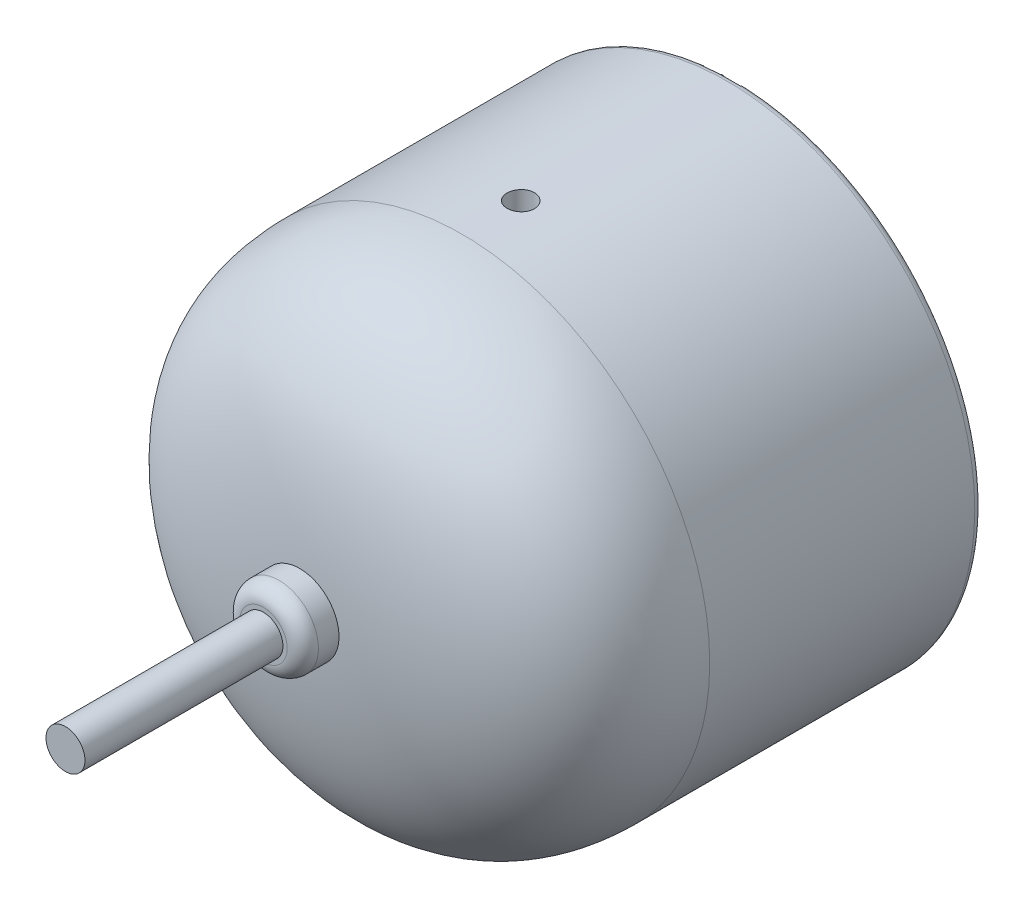
ISO-10303-21;
HEADER;
FILE_DESCRIPTION(('STEP AP214'),'2;1');
FILE_NAME('part.step','',(''),(''),'','','');
FILE_SCHEMA(('AUTOMOTIVE_DESIGN { 1 0 10303 214 1 1 1 1 }'));
ENDSEC;
DATA;
#1=APPLICATION_CONTEXT('core data for automotive mechanical design processes');
#2=APPLICATION_PROTOCOL_DEFINITION('international standard','automotive_design',2000,#1);
#3=PRODUCT_CONTEXT('',#1,'mechanical');
#4=PRODUCT('Part','Part','',(#3));
#5=PRODUCT_RELATED_PRODUCT_CATEGORY('part','',(#4));
#6=PRODUCT_DEFINITION_FORMATION('','',#4);
#7=PRODUCT_DEFINITION_CONTEXT('part definition',#1,'design');
#8=PRODUCT_DEFINITION('design','',#6,#7);
#9=PRODUCT_DEFINITION_SHAPE('','',#8);
#10=(LENGTH_UNIT() NAMED_UNIT(*) SI_UNIT(.MILLI.,.METRE.));
#11=(NAMED_UNIT(*) PLANE_ANGLE_UNIT() SI_UNIT($,.RADIAN.));
#12=(NAMED_UNIT(*) SI_UNIT($,.STERADIAN.) SOLID_ANGLE_UNIT());
#13=UNCERTAINTY_MEASURE_WITH_UNIT(LENGTH_MEASURE(1.E-05),#10,'distance_accuracy_value','');
#14=(GEOMETRIC_REPRESENTATION_CONTEXT(3) GLOBAL_UNCERTAINTY_ASSIGNED_CONTEXT((#13)) GLOBAL_UNIT_ASSIGNED_CONTEXT((#10,
#11,#12)) REPRESENTATION_CONTEXT('',''));
#15=CARTESIAN_POINT('',(0.,0.,0.));
#16=DIRECTION('',(0.,0.,1.));
#17=DIRECTION('',(1.,0.,0.));
#18=AXIS2_PLACEMENT_3D('',#15,#16,#17);
#19=CARTESIAN_POINT('',(0.,0.,28.5));
#20=CARTESIAN_POINT('',(23.2955749042414,0.,28.5));
#21=CARTESIAN_POINT('',(31.75,0.,20.2065098428712));
#22=CARTESIAN_POINT('',(31.75,0.,7.5));
#23=B_SPLINE_CURVE_WITH_KNOTS('',3,(#19,#20,#21,#22),.UNSPECIFIED.,.F.,.F.,(4,4),(0.,1.),.UNSPECIFIED.);
#24=CARTESIAN_POINT('',(0.,0.,-65.3333333333333));
#25=DIRECTION('',(0.,0.,-1.));
#26=AXIS1_PLACEMENT('',#24,#25);
#27=SURFACE_OF_REVOLUTION('',#23,#26);
#28=CARTESIAN_POINT('',(0.,0.,7.50000000000001));
#29=DIRECTION('',(0.,0.,-1.));
#30=DIRECTION('',(-1.,0.,0.));
#31=AXIS2_PLACEMENT_3D('',#28,#29,#30);
#32=CIRCLE('',#31,31.75);
#33=CARTESIAN_POINT('',(-31.75,0.,7.50000000000001));
#34=VERTEX_POINT('',#33);
#35=EDGE_CURVE('E94',#34,#34,#32,.T.);
#36=ORIENTED_EDGE('',*,*,#35,.F.);
#37=EDGE_LOOP('',(#36));
#38=FACE_BOUND('',#37,.T.);
#39=CARTESIAN_POINT('',(0.,0.,28.3584063415116));
#40=DIRECTION('',(0.,0.,-1.));
#41=DIRECTION('',(-1.,0.,0.));
#42=AXIS2_PLACEMENT_3D('',#39,#40,#41);
#43=CIRCLE('',#42,5.05);
#44=CARTESIAN_POINT('',(-5.05,0.,28.3584063415116));
#45=VERTEX_POINT('',#44);
#46=EDGE_CURVE('E46',#45,#45,#43,.F.);
#47=ORIENTED_EDGE('',*,*,#46,.F.);
#48=EDGE_LOOP('',(#47));
#49=FACE_BOUND('',#48,.T.);
#50=ADVANCED_FACE('F35',(#38,#49),#27,.T.);
#51=CARTESIAN_POINT('',(0.,0.,-65.3333333333333));
#52=DIRECTION('',(0.,0.,-1.));
#53=DIRECTION('',(-1.,0.,0.));
#54=AXIS2_PLACEMENT_3D('',#51,#52,#53);
#55=CYLINDRICAL_SURFACE('',#54,31.75);
#56=CARTESIAN_POINT('',(0.,-31.75,1.75));
#57=CARTESIAN_POINT('',(0.098218259722609,-31.7499993563178,1.74999567021692));
#58=CARTESIAN_POINT('',(0.196505835676113,-31.7495393659802,1.74170351482787));
#59=CARTESIAN_POINT('',(0.390368611015518,-31.7477485953859,1.70874260433731));
#60=CARTESIAN_POINT('',(0.485940492222386,-31.7464167939341,1.68405464353169));
#61=CARTESIAN_POINT('',(0.671535598846316,-31.743033109964,1.61901197788316));
#62=CARTESIAN_POINT('',(0.761561662240297,-31.7409815994041,1.57866536456658));
#63=CARTESIAN_POINT('',(0.933539373825538,-31.7363894273858,1.48346338472939));
#64=CARTESIAN_POINT('',(1.01549290017427,-31.733848880115,1.42861140402442));
#65=CARTESIAN_POINT('',(1.16912132856623,-31.7285609441302,1.30588318933266));
#66=CARTESIAN_POINT('',(1.24078533826117,-31.7258133408515,1.237993328695));
#67=CARTESIAN_POINT('',(1.37170748291896,-31.72042280655,1.09114412094473));
#68=CARTESIAN_POINT('',(1.43096510670865,-31.7177798798436,1.01218431794737));
#69=CARTESIAN_POINT('',(1.53542406813744,-31.7128951542243,0.845377327561351));
#70=CARTESIAN_POINT('',(1.58061664486936,-31.7106536056915,0.757524645895807));
#71=CARTESIAN_POINT('',(1.6556065270842,-31.7068271042245,0.575464319292522));
#72=CARTESIAN_POINT('',(1.68540396800605,-31.705242145514,0.481256730270412));
#73=CARTESIAN_POINT('',(1.72872827538304,-31.7029095466366,0.289263246675951));
#74=CARTESIAN_POINT('',(1.7422718028822,-31.702161049111,0.191481122336334));
#75=CARTESIAN_POINT('',(1.75275524924749,-31.7015832087885,-0.00497132397619619));
#76=CARTESIAN_POINT('',(1.74969532094304,-31.7017538575312,-0.103641637765268));
#77=CARTESIAN_POINT('',(1.72707257102549,-31.7029942693388,-0.29895622187124));
#78=CARTESIAN_POINT('',(1.70752776094696,-31.7040630510905,-0.395602585511063));
#79=CARTESIAN_POINT('',(1.6525179750227,-31.7069777278299,-0.58424059183585));
#80=CARTESIAN_POINT('',(1.61705292112457,-31.7088236266276,-0.676232211697473));
#81=CARTESIAN_POINT('',(1.53118884667236,-31.7130856300472,-0.853007394933343));
#82=CARTESIAN_POINT('',(1.48078163016413,-31.7155020474569,-0.937786969483742));
#83=CARTESIAN_POINT('',(1.36647006350392,-31.7206324328377,-1.09768786281156));
#84=CARTESIAN_POINT('',(1.30256559647437,-31.7233464033853,-1.17280909794486));
#85=CARTESIAN_POINT('',(1.16297197598234,-31.7287703812914,-1.31136571387167));
#86=CARTESIAN_POINT('',(1.08726722891817,-31.7314803785462,-1.37478538581636));
#87=CARTESIAN_POINT('',(0.926276777614297,-31.7365875023848,-1.48801752981671));
#88=CARTESIAN_POINT('',(0.840991070670397,-31.7389846288803,-1.53782999803178));
#89=CARTESIAN_POINT('',(0.663250327414738,-31.7431960032909,-1.62243230378617));
#90=CARTESIAN_POINT('',(0.570795021101892,-31.7450102292412,-1.65722157524013));
#91=CARTESIAN_POINT('',(0.381343689553849,-31.7478510378092,-1.71077959395125));
#92=CARTESIAN_POINT('',(0.284347705600349,-31.7488776275862,-1.72954848682831));
#93=CARTESIAN_POINT('',(0.0887047213667673,-31.7500265512202,-1.75051356768692));
#94=CARTESIAN_POINT('',(-0.00993994424777704,-31.7501500704359,-1.75273148035133));
#95=CARTESIAN_POINT('',(-0.206199991547844,-31.749482082264,-1.740588363029));
#96=CARTESIAN_POINT('',(-0.303815377381847,-31.7486905785658,-1.7262273998887));
#97=CARTESIAN_POINT('',(-0.495184923838054,-31.7462824391106,-1.68135216956038));
#98=CARTESIAN_POINT('',(-0.588941421748196,-31.744666311011,-1.65084784016259));
#99=CARTESIAN_POINT('',(-0.770003844019816,-31.7407908249894,-1.57456186476626));
#100=CARTESIAN_POINT('',(-0.85730972321365,-31.7385314625641,-1.52878011180661));
#101=CARTESIAN_POINT('',(-1.02309226561279,-31.7336206073764,-1.4231833654163));
#102=CARTESIAN_POINT('',(-1.10155965369333,-31.7309687093149,-1.36335382954706));
#103=CARTESIAN_POINT('',(-1.24734451157135,-31.7255727125815,-1.23138107452393));
#104=CARTESIAN_POINT('',(-1.3146618952417,-31.7228286131977,-1.15923776026218));
#105=CARTESIAN_POINT('',(-1.43630916495567,-31.7175540957262,-1.00459177019346));
#106=CARTESIAN_POINT('',(-1.49062498051277,-31.7150239110376,-0.922078017252651));
#107=CARTESIAN_POINT('',(-1.5846310923149,-31.7104662336804,-0.749089265378817));
#108=CARTESIAN_POINT('',(-1.62432146241487,-31.7084387384733,-0.658614306650801));
#109=CARTESIAN_POINT('',(-1.68792554897618,-31.7051167502992,-0.472323241898425));
#110=CARTESIAN_POINT('',(-1.71184819162935,-31.7038218426694,-0.376510191172936));
#111=CARTESIAN_POINT('',(-1.74326692545763,-31.7021098951692,-0.182220090519093));
#112=CARTESIAN_POINT('',(-1.75076313652954,-31.7016928488912,-0.0837430600404834));
#113=CARTESIAN_POINT('',(-1.7491150868242,-31.7017838099062,0.112939609913565));
#114=CARTESIAN_POINT('',(-1.73999295479167,-31.7022905870499,0.211145436148763));
#115=CARTESIAN_POINT('',(-1.70541295923067,-31.7041694789465,0.404628944302418));
#116=CARTESIAN_POINT('',(-1.67995506510834,-31.70554159532,0.49990662073664));
#117=CARTESIAN_POINT('',(-1.61343092283431,-31.7089962389526,0.684833323058575));
#118=CARTESIAN_POINT('',(-1.57236463598152,-31.7110787679731,0.774482334989343));
#119=CARTESIAN_POINT('',(-1.47579287394042,-31.7157194785986,0.945615276983652));
#120=CARTESIAN_POINT('',(-1.42028781531786,-31.7182776464805,1.02709944251314));
#121=CARTESIAN_POINT('',(-1.29633356969077,-31.7235852535782,1.17970101651865));
#122=CARTESIAN_POINT('',(-1.22786867594803,-31.7263349223016,1.25080565831959));
#123=CARTESIAN_POINT('',(-1.0799538989618,-31.7317138576378,1.38053524748758));
#124=CARTESIAN_POINT('',(-1.0005013231396,-31.7343430945275,1.43915712692964));
#125=CARTESIAN_POINT('',(-0.832793499387054,-31.7391870585348,1.54229052706746));
#126=CARTESIAN_POINT('',(-0.744528973708246,-31.7414013415571,1.58678696524995));
#127=CARTESIAN_POINT('',(-0.561835060352505,-31.7451595441451,1.66027525291606));
#128=CARTESIAN_POINT('',(-0.467413078672168,-31.7467042525498,1.68928535654048));
#129=CARTESIAN_POINT('',(-0.310339878367554,-31.7485421207953,1.72339461360374));
#130=CARTESIAN_POINT('',(-0.248705273226567,-31.7490864125337,1.73335883350712));
#131=CARTESIAN_POINT('',(-0.124723096974011,-31.7498155563389,1.74666289808154));
#132=CARTESIAN_POINT('',(-0.0623755266121657,-31.7500004087837,1.75000274971783));
#133=CARTESIAN_POINT('',(0.,-31.75,1.75));
#134=B_SPLINE_CURVE_WITH_KNOTS('',3,(#56,#57,#58,#59,#60,#61,#62,#63,#64,#65,#66,#67,#68,#69,
#70,#71,#72,#73,#74,#75,#76,#77,#78,#79,#80,#81,#82,#83,#84,#85,#86,#87,#88,#89,#90,#91,#92,#93,
#94,#95,#96,#97,#98,#99,#100,#101,#102,#103,#104,#105,#106,#107,#108,#109,#110,#111,#112,#113,
#114,#115,#116,#117,#118,#119,#120,#121,#122,#123,#124,#125,#126,#127,#128,#129,#130,#131,#132,
#133),.UNSPECIFIED.,.T.,.F.,(4,2,2,2,2,2,2,2,2,2,2,2,2,2,2,2,2,2,2,2,2,2,2,2,2,2,2,2,2,2,2,2,2,
2,2,2,2,2,4),(0.,0.29442707999695,0.589199655475054,0.883820111152348,1.17837185768391,
1.47323314958422,1.76810658809471,2.06316333294353,2.3582174819822,2.65296892727664,
2.94771765948431,3.24214476305564,3.53657331013476,3.83116365455915,4.12575655005245,
4.42074209135197,4.71572771591018,5.01072445477895,5.30571851219735,5.60032529457932,
5.89493088910365,6.18935533622883,6.48378184473741,6.77851450159732,7.07324943498505,
7.36830190715354,7.66335288935842,7.95823669789173,8.2531183540558,8.54760763705288,
8.8420974715756,9.13658803629207,9.4310701057513,9.72591138621028,10.0208250472471,
10.3160525528938,10.610931293566,10.7979134649637,10.984895439757),.UNSPECIFIED.);
#135=CARTESIAN_POINT('',(0.,-31.75,1.75));
#136=VERTEX_POINT('',#135);
#137=EDGE_CURVE('E59',#136,#136,#134,.T.);
#138=ORIENTED_EDGE('',*,*,#137,.T.);
#139=EDGE_LOOP('',(#138));
#140=FACE_BOUND('',#139,.T.);
#141=CARTESIAN_POINT('',(0.,0.,-26.5));
#142=DIRECTION('',(0.,0.,-1.));
#143=DIRECTION('',(-1.,0.,0.));
#144=AXIS2_PLACEMENT_3D('',#141,#142,#143);
#145=CIRCLE('',#144,31.75);
#146=CARTESIAN_POINT('',(-31.75,0.,-26.5));
#147=VERTEX_POINT('',#146);
#148=EDGE_CURVE('E100',#147,#147,#145,.T.);
#149=ORIENTED_EDGE('',*,*,#148,.F.);
#150=EDGE_LOOP('',(#149));
#151=FACE_BOUND('',#150,.T.);
#152=ORIENTED_EDGE('',*,*,#35,.T.);
#153=EDGE_LOOP('',(#152));
#154=FACE_BOUND('',#153,.T.);
#155=CARTESIAN_POINT('',(0.,31.75,-1.75));
#156=CARTESIAN_POINT('',(-0.098218259722609,31.7499993563178,-1.74999567021692));
#157=CARTESIAN_POINT('',(-0.196505835676113,31.7495393659802,-1.74170351482787));
#158=CARTESIAN_POINT('',(-0.390368611015518,31.7477485953859,-1.70874260433731));
#159=CARTESIAN_POINT('',(-0.485940492222386,31.7464167939341,-1.68405464353169));
#160=CARTESIAN_POINT('',(-0.671535598846316,31.743033109964,-1.61901197788316));
#161=CARTESIAN_POINT('',(-0.761561662240297,31.7409815994041,-1.57866536456658));
#162=CARTESIAN_POINT('',(-0.933539373825538,31.7363894273858,-1.48346338472939));
#163=CARTESIAN_POINT('',(-1.01549290017427,31.733848880115,-1.42861140402442));
#164=CARTESIAN_POINT('',(-1.16912132856623,31.7285609441302,-1.30588318933266));
#165=CARTESIAN_POINT('',(-1.24078533826117,31.7258133408515,-1.237993328695));
#166=CARTESIAN_POINT('',(-1.37170748291896,31.72042280655,-1.09114412094473));
#167=CARTESIAN_POINT('',(-1.43096510670865,31.7177798798436,-1.01218431794737));
#168=CARTESIAN_POINT('',(-1.53542406813744,31.7128951542243,-0.845377327561351));
#169=CARTESIAN_POINT('',(-1.58061664486936,31.7106536056915,-0.757524645895807));
#170=CARTESIAN_POINT('',(-1.6556065270842,31.7068271042245,-0.575464319292522));
#171=CARTESIAN_POINT('',(-1.68540396800605,31.705242145514,-0.481256730270412));
#172=CARTESIAN_POINT('',(-1.72872827538304,31.7029095466366,-0.289263246675951));
#173=CARTESIAN_POINT('',(-1.7422718028822,31.702161049111,-0.191481122336334));
#174=CARTESIAN_POINT('',(-1.75275524924749,31.7015832087885,0.00497132397619619));
#175=CARTESIAN_POINT('',(-1.74969532094304,31.7017538575312,0.103641637765268));
#176=CARTESIAN_POINT('',(-1.72707257102549,31.7029942693388,0.29895622187124));
#177=CARTESIAN_POINT('',(-1.70752776094696,31.7040630510905,0.395602585511063));
#178=CARTESIAN_POINT('',(-1.6525179750227,31.7069777278299,0.58424059183585));
#179=CARTESIAN_POINT('',(-1.61705292112457,31.7088236266276,0.676232211697473));
#180=CARTESIAN_POINT('',(-1.53118884667236,31.7130856300472,0.853007394933343));
#181=CARTESIAN_POINT('',(-1.48078163016413,31.7155020474569,0.937786969483742));
#182=CARTESIAN_POINT('',(-1.36647006350392,31.7206324328377,1.09768786281156));
#183=CARTESIAN_POINT('',(-1.30256559647437,31.7233464033853,1.17280909794486));
#184=CARTESIAN_POINT('',(-1.16297197598234,31.7287703812914,1.31136571387167));
#185=CARTESIAN_POINT('',(-1.08726722891817,31.7314803785462,1.37478538581636));
#186=CARTESIAN_POINT('',(-0.926276777614297,31.7365875023848,1.48801752981671));
#187=CARTESIAN_POINT('',(-0.840991070670397,31.7389846288803,1.53782999803178));
#188=CARTESIAN_POINT('',(-0.663250327414738,31.7431960032909,1.62243230378617));
#189=CARTESIAN_POINT('',(-0.570795021101892,31.7450102292412,1.65722157524013));
#190=CARTESIAN_POINT('',(-0.381343689553849,31.7478510378092,1.71077959395125));
#191=CARTESIAN_POINT('',(-0.284347705600349,31.7488776275862,1.72954848682831));
#192=CARTESIAN_POINT('',(-0.0887047213667673,31.7500265512202,1.75051356768692));
#193=CARTESIAN_POINT('',(0.00993994424777704,31.7501500704359,1.75273148035133));
#194=CARTESIAN_POINT('',(0.206199991547844,31.749482082264,1.740588363029));
#195=CARTESIAN_POINT('',(0.303815377381847,31.7486905785658,1.7262273998887));
#196=CARTESIAN_POINT('',(0.495184923838054,31.7462824391106,1.68135216956038));
#197=CARTESIAN_POINT('',(0.588941421748196,31.744666311011,1.65084784016259));
#198=CARTESIAN_POINT('',(0.770003844019816,31.7407908249894,1.57456186476626));
#199=CARTESIAN_POINT('',(0.85730972321365,31.7385314625641,1.52878011180661));
#200=CARTESIAN_POINT('',(1.02309226561279,31.7336206073764,1.4231833654163));
#201=CARTESIAN_POINT('',(1.10155965369333,31.7309687093149,1.36335382954706));
#202=CARTESIAN_POINT('',(1.24734451157135,31.7255727125815,1.23138107452393));
#203=CARTESIAN_POINT('',(1.3146618952417,31.7228286131977,1.15923776026218));
#204=CARTESIAN_POINT('',(1.43630916495567,31.7175540957262,1.00459177019346));
#205=CARTESIAN_POINT('',(1.49062498051277,31.7150239110376,0.922078017252651));
#206=CARTESIAN_POINT('',(1.5846310923149,31.7104662336804,0.749089265378817));
#207=CARTESIAN_POINT('',(1.62432146241487,31.7084387384733,0.658614306650801));
#208=CARTESIAN_POINT('',(1.68792554897618,31.7051167502992,0.472323241898425));
#209=CARTESIAN_POINT('',(1.71184819162935,31.7038218426694,0.376510191172936));
#210=CARTESIAN_POINT('',(1.74326692545763,31.7021098951692,0.182220090519093));
#211=CARTESIAN_POINT('',(1.75076313652954,31.7016928488912,0.0837430600404834));
#212=CARTESIAN_POINT('',(1.7491150868242,31.7017838099062,-0.112939609913565));
#213=CARTESIAN_POINT('',(1.73999295479167,31.7022905870499,-0.211145436148763));
#214=CARTESIAN_POINT('',(1.70541295923067,31.7041694789465,-0.404628944302418));
#215=CARTESIAN_POINT('',(1.67995506510834,31.70554159532,-0.49990662073664));
#216=CARTESIAN_POINT('',(1.61343092283431,31.7089962389526,-0.684833323058575));
#217=CARTESIAN_POINT('',(1.57236463598152,31.7110787679731,-0.774482334989343));
#218=CARTESIAN_POINT('',(1.47579287394042,31.7157194785986,-0.945615276983652));
#219=CARTESIAN_POINT('',(1.42028781531786,31.7182776464805,-1.02709944251314));
#220=CARTESIAN_POINT('',(1.29633356969077,31.7235852535782,-1.17970101651865));
#221=CARTESIAN_POINT('',(1.22786867594803,31.7263349223016,-1.25080565831959));
#222=CARTESIAN_POINT('',(1.0799538989618,31.7317138576378,-1.38053524748758));
#223=CARTESIAN_POINT('',(1.0005013231396,31.7343430945275,-1.43915712692964));
#224=CARTESIAN_POINT('',(0.832793499387054,31.7391870585348,-1.54229052706746));
#225=CARTESIAN_POINT('',(0.744528973708246,31.7414013415571,-1.58678696524995));
#226=CARTESIAN_POINT('',(0.561835060352505,31.7451595441451,-1.66027525291606));
#227=CARTESIAN_POINT('',(0.467413078672168,31.7467042525498,-1.68928535654048));
#228=CARTESIAN_POINT('',(0.310339878367554,31.7485421207953,-1.72339461360374));
#229=CARTESIAN_POINT('',(0.248705273226567,31.7490864125337,-1.73335883350712));
#230=CARTESIAN_POINT('',(0.124723096974011,31.7498155563389,-1.74666289808154));
#231=CARTESIAN_POINT('',(0.0623755266121657,31.7500004087837,-1.75000274971783));
#232=CARTESIAN_POINT('',(0.,31.75,-1.75));
#233=B_SPLINE_CURVE_WITH_KNOTS('',3,(#155,#156,#157,#158,#159,#160,#161,#162,#163,#164,#165,
#166,#167,#168,#169,#170,#171,#172,#173,#174,#175,#176,#177,#178,#179,#180,#181,#182,#183,#184,
#185,#186,#187,#188,#189,#190,#191,#192,#193,#194,#195,#196,#197,#198,#199,#200,#201,#202,#203,
#204,#205,#206,#207,#208,#209,#210,#211,#212,#213,#214,#215,#216,#217,#218,#219,#220,#221,#222,
#223,#224,#225,#226,#227,#228,#229,#230,#231,#232),.UNSPECIFIED.,.T.,.F.,(4,2,2,2,2,2,2,2,2,2,2,
2,2,2,2,2,2,2,2,2,2,2,2,2,2,2,2,2,2,2,2,2,2,2,2,2,2,2,4),(0.,0.29442707999695,0.589199655475054,
0.883820111152348,1.17837185768391,1.47323314958422,1.76810658809471,2.06316333294353,
2.3582174819822,2.65296892727664,2.94771765948431,3.24214476305564,3.53657331013476,
3.83116365455915,4.12575655005245,4.42074209135197,4.71572771591018,5.01072445477895,
5.30571851219735,5.60032529457932,5.89493088910365,6.18935533622883,6.48378184473741,
6.77851450159732,7.07324943498505,7.36830190715354,7.66335288935842,7.95823669789173,
8.2531183540558,8.54760763705288,8.8420974715756,9.13658803629207,9.4310701057513,
9.72591138621028,10.0208250472471,10.3160525528938,10.610931293566,10.7979134649637,
10.984895439757),.UNSPECIFIED.);
#234=CARTESIAN_POINT('',(0.,31.75,-1.75));
#235=VERTEX_POINT('',#234);
#236=EDGE_CURVE('E50',#235,#235,#233,.T.);
#237=ORIENTED_EDGE('',*,*,#236,.F.);
#238=EDGE_LOOP('',(#237));
#239=FACE_BOUND('',#238,.T.);
#240=ADVANCED_FACE('F64',(#140,#151,#154,#239),#55,.T.);
#241=CARTESIAN_POINT('',(0.,0.,-25.32));
#242=DIRECTION('',(0.,0.,1.));
#243=DIRECTION('',(1.,0.,0.));
#244=AXIS2_PLACEMENT_3D('',#241,#242,#243);
#245=PLANE('',#244);
#246=CARTESIAN_POINT('',(0.,0.,-25.32));
#247=DIRECTION('',(0.,0.,-1.));
#248=DIRECTION('',(-1.,0.,0.));
#249=AXIS2_PLACEMENT_3D('',#246,#247,#248);
#250=CIRCLE('',#249,27.625);
#251=CARTESIAN_POINT('',(-27.625,0.,-25.32));
#252=VERTEX_POINT('',#251);
#253=EDGE_CURVE('E111',#252,#252,#250,.T.);
#254=ORIENTED_EDGE('',*,*,#253,.T.);
#255=EDGE_LOOP('',(#254));
#256=FACE_BOUND('',#255,.T.);
#257=ADVANCED_FACE('F121',(#256),#245,.F.);
#258=CARTESIAN_POINT('',(0.,0.,-65.3333333333333));
#259=DIRECTION('',(0.,0.,-1.));
#260=DIRECTION('',(-1.,0.,0.));
#261=AXIS2_PLACEMENT_3D('',#258,#259,#260);
#262=CYLINDRICAL_SURFACE('',#261,27.625);
#263=ORIENTED_EDGE('',*,*,#253,.F.);
#264=EDGE_LOOP('',(#263));
#265=FACE_BOUND('',#264,.T.);
#266=CARTESIAN_POINT('',(0.,0.,-26.5));
#267=DIRECTION('',(0.,0.,-1.));
#268=DIRECTION('',(-1.,0.,0.));
#269=AXIS2_PLACEMENT_3D('',#266,#267,#268);
#270=CIRCLE('',#269,27.625);
#271=CARTESIAN_POINT('',(-27.625,0.,-26.5));
#272=VERTEX_POINT('',#271);
#273=EDGE_CURVE('E109',#272,#272,#270,.T.);
#274=ORIENTED_EDGE('',*,*,#273,.T.);
#275=EDGE_LOOP('',(#274));
#276=FACE_BOUND('',#275,.T.);
#277=ADVANCED_FACE('F248',(#265,#276),#262,.F.);
#278=CARTESIAN_POINT('',(0.,0.,-26.5));
#279=DIRECTION('',(0.,0.,-1.));
#280=DIRECTION('',(-1.,0.,0.));
#281=AXIS2_PLACEMENT_3D('',#278,#279,#280);
#282=TOROIDAL_SURFACE('',#281,28.625,1.);
#283=ORIENTED_EDGE('',*,*,#273,.F.);
#284=EDGE_LOOP('',(#283));
#285=FACE_BOUND('',#284,.T.);
#286=CARTESIAN_POINT('',(0.,0.,-27.5));
#287=DIRECTION('',(0.,0.,-1.));
#288=DIRECTION('',(-1.,0.,0.));
#289=AXIS2_PLACEMENT_3D('',#286,#287,#288);
#290=CIRCLE('',#289,28.625);
#291=CARTESIAN_POINT('',(-28.625,0.,-27.5));
#292=VERTEX_POINT('',#291);
#293=EDGE_CURVE('E106',#292,#292,#290,.T.);
#294=ORIENTED_EDGE('',*,*,#293,.T.);
#295=EDGE_LOOP('',(#294));
#296=FACE_BOUND('',#295,.T.);
#297=ADVANCED_FACE('F239',(#285,#296),#282,.T.);
#298=CARTESIAN_POINT('',(28.625,0.,-27.5));
#299=DIRECTION('',(0.,0.,1.));
#300=DIRECTION('',(1.,0.,0.));
#301=AXIS2_PLACEMENT_3D('',#298,#299,#300);
#302=PLANE('',#301);
#303=ORIENTED_EDGE('',*,*,#293,.F.);
#304=EDGE_LOOP('',(#303));
#305=FACE_BOUND('',#304,.T.);
#306=CARTESIAN_POINT('',(0.,0.,-27.5));
#307=DIRECTION('',(0.,0.,-1.));
#308=DIRECTION('',(-1.,0.,0.));
#309=AXIS2_PLACEMENT_3D('',#306,#307,#308);
#310=CIRCLE('',#309,30.75);
#311=CARTESIAN_POINT('',(-30.75,0.,-27.5));
#312=VERTEX_POINT('',#311);
#313=EDGE_CURVE('E103',#312,#312,#310,.T.);
#314=ORIENTED_EDGE('',*,*,#313,.T.);
#315=EDGE_LOOP('',(#314));
#316=FACE_BOUND('',#315,.T.);
#317=ADVANCED_FACE('F231',(#305,#316),#302,.F.);
#318=CARTESIAN_POINT('',(0.,0.,-26.5));
#319=DIRECTION('',(0.,0.,-1.));
#320=DIRECTION('',(-1.,0.,0.));
#321=AXIS2_PLACEMENT_3D('',#318,#319,#320);
#322=TOROIDAL_SURFACE('',#321,30.75,1.);
#323=ORIENTED_EDGE('',*,*,#313,.F.);
#324=EDGE_LOOP('',(#323));
#325=FACE_BOUND('',#324,.T.);
#326=ORIENTED_EDGE('',*,*,#148,.T.);
#327=EDGE_LOOP('',(#326));
#328=FACE_BOUND('',#327,.T.);
#329=ADVANCED_FACE('F82',(#325,#328),#322,.T.);
#330=CARTESIAN_POINT('',(0.,-31.75,0.));
#331=DIRECTION('',(0.,1.,0.));
#332=DIRECTION('',(0.,0.,1.));
#333=AXIS2_PLACEMENT_3D('',#330,#331,#332);
#334=CYLINDRICAL_SURFACE('',#333,1.75);
#335=CARTESIAN_POINT('',(0.,-27.,0.));
#336=DIRECTION('',(0.,1.,0.));
#337=DIRECTION('',(0.,0.,1.));
#338=AXIS2_PLACEMENT_3D('',#335,#336,#337);
#339=CIRCLE('',#338,1.75);
#340=CARTESIAN_POINT('',(0.,-27.,1.75));
#341=VERTEX_POINT('',#340);
#342=EDGE_CURVE('E92',#341,#341,#339,.T.);
#343=ORIENTED_EDGE('',*,*,#342,.T.);
#344=EDGE_LOOP('',(#343));
#345=FACE_BOUND('',#344,.T.);
#346=ORIENTED_EDGE('',*,*,#137,.F.);
#347=EDGE_LOOP('',(#346));
#348=FACE_BOUND('',#347,.T.);
#349=ADVANCED_FACE('F78',(#345,#348),#334,.F.);
#350=CARTESIAN_POINT('',(0.,-27.,0.));
#351=DIRECTION('',(0.,1.,0.));
#352=DIRECTION('',(0.,0.,1.));
#353=AXIS2_PLACEMENT_3D('',#350,#351,#352);
#354=PLANE('',#353);
#355=ORIENTED_EDGE('',*,*,#342,.F.);
#356=EDGE_LOOP('',(#355));
#357=FACE_BOUND('',#356,.T.);
#358=ADVANCED_FACE('F74',(#357),#354,.F.);
#359=CARTESIAN_POINT('',(0.,31.75,0.));
#360=DIRECTION('',(0.,-1.,0.));
#361=DIRECTION('',(0.,0.,-1.));
#362=AXIS2_PLACEMENT_3D('',#359,#360,#361);
#363=CYLINDRICAL_SURFACE('',#362,1.75);
#364=CARTESIAN_POINT('',(0.,27.,0.));
#365=DIRECTION('',(0.,1.,0.));
#366=DIRECTION('',(0.,0.,1.));
#367=AXIS2_PLACEMENT_3D('',#364,#365,#366);
#368=CIRCLE('',#367,1.75);
#369=CARTESIAN_POINT('',(0.,27.,1.75));
#370=VERTEX_POINT('',#369);
#371=EDGE_CURVE('E154',#370,#370,#368,.T.);
#372=ORIENTED_EDGE('',*,*,#371,.F.);
#373=EDGE_LOOP('',(#372));
#374=FACE_BOUND('',#373,.T.);
#375=ORIENTED_EDGE('',*,*,#236,.T.);
#376=EDGE_LOOP('',(#375));
#377=FACE_BOUND('',#376,.T.);
#378=ADVANCED_FACE('F68',(#374,#377),#363,.F.);
#379=CARTESIAN_POINT('',(0.,27.,0.));
#380=DIRECTION('',(0.,-1.,0.));
#381=DIRECTION('',(0.,0.,1.));
#382=AXIS2_PLACEMENT_3D('',#379,#380,#381);
#383=PLANE('',#382);
#384=ORIENTED_EDGE('',*,*,#371,.T.);
#385=EDGE_LOOP('',(#384));
#386=FACE_BOUND('',#385,.T.);
#387=ADVANCED_FACE('F73',(#386),#383,.F.);
#388=CARTESIAN_POINT('',(0.,0.,33.));
#389=DIRECTION('',(0.,0.,-1.));
#390=DIRECTION('',(-1.,0.,0.));
#391=AXIS2_PLACEMENT_3D('',#388,#389,#390);
#392=CYLINDRICAL_SURFACE('',#391,5.05);
#393=CARTESIAN_POINT('',(0.,0.,31.));
#394=DIRECTION('',(0.,0.,1.));
#395=DIRECTION('',(1.,0.,0.));
#396=AXIS2_PLACEMENT_3D('',#393,#394,#395);
#397=CIRCLE('',#396,5.05);
#398=CARTESIAN_POINT('',(5.05,0.,31.));
#399=VERTEX_POINT('',#398);
#400=EDGE_CURVE('E10',#399,#399,#397,.F.);
#401=ORIENTED_EDGE('',*,*,#400,.T.);
#402=EDGE_LOOP('',(#401));
#403=FACE_BOUND('',#402,.T.);
#404=ORIENTED_EDGE('',*,*,#46,.T.);
#405=EDGE_LOOP('',(#404));
#406=FACE_BOUND('',#405,.T.);
#407=ADVANCED_FACE('F131',(#403,#406),#392,.T.);
#408=CARTESIAN_POINT('',(0.,0.,33.));
#409=DIRECTION('',(0.,0.,1.));
#410=DIRECTION('',(1.,0.,0.));
#411=AXIS2_PLACEMENT_3D('',#408,#409,#410);
#412=PLANE('',#411);
#413=CARTESIAN_POINT('',(0.,0.,33.));
#414=DIRECTION('',(0.,0.,1.));
#415=DIRECTION('',(1.,0.,0.));
#416=AXIS2_PLACEMENT_3D('',#413,#414,#415);
#417=CIRCLE('',#416,2.5);
#418=CARTESIAN_POINT('',(2.5,0.,33.));
#419=VERTEX_POINT('',#418);
#420=EDGE_CURVE('E155',#419,#419,#417,.T.);
#421=ORIENTED_EDGE('',*,*,#420,.F.);
#422=EDGE_LOOP('',(#421));
#423=FACE_BOUND('',#422,.T.);
#424=CARTESIAN_POINT('',(0.,0.,33.));
#425=DIRECTION('',(0.,0.,1.));
#426=DIRECTION('',(1.,0.,0.));
#427=AXIS2_PLACEMENT_3D('',#424,#425,#426);
#428=CIRCLE('',#427,3.05);
#429=CARTESIAN_POINT('',(3.05,0.,33.));
#430=VERTEX_POINT('',#429);
#431=EDGE_CURVE('E42',#430,#430,#428,.T.);
#432=ORIENTED_EDGE('',*,*,#431,.T.);
#433=EDGE_LOOP('',(#432));
#434=FACE_BOUND('',#433,.T.);
#435=ADVANCED_FACE('F133',(#423,#434),#412,.T.);
#436=CARTESIAN_POINT('',(0.,0.,31.));
#437=DIRECTION('',(0.,0.,1.));
#438=DIRECTION('',(1.,0.,0.));
#439=AXIS2_PLACEMENT_3D('',#436,#437,#438);
#440=TOROIDAL_SURFACE('',#439,3.05,2.);
#441=ORIENTED_EDGE('',*,*,#400,.F.);
#442=EDGE_LOOP('',(#441));
#443=FACE_BOUND('',#442,.T.);
#444=ORIENTED_EDGE('',*,*,#431,.F.);
#445=EDGE_LOOP('',(#444));
#446=FACE_BOUND('',#445,.T.);
#447=ADVANCED_FACE('F37',(#443,#446),#440,.T.);
#448=CARTESIAN_POINT('',(0.,0.,58.4));
#449=DIRECTION('',(0.,0.,-1.));
#450=DIRECTION('',(-1.,0.,0.));
#451=AXIS2_PLACEMENT_3D('',#448,#449,#450);
#452=CYLINDRICAL_SURFACE('',#451,2.5);
#453=CARTESIAN_POINT('',(0.,0.,58.4));
#454=DIRECTION('',(0.,0.,1.));
#455=DIRECTION('',(1.,0.,0.));
#456=AXIS2_PLACEMENT_3D('',#453,#454,#455);
#457=CIRCLE('',#456,2.5);
#458=CARTESIAN_POINT('',(2.5,0.,58.4));
#459=VERTEX_POINT('',#458);
#460=EDGE_CURVE('E153',#459,#459,#457,.T.);
#461=ORIENTED_EDGE('',*,*,#460,.F.);
#462=EDGE_LOOP('',(#461));
#463=FACE_BOUND('',#462,.T.);
#464=ORIENTED_EDGE('',*,*,#420,.T.);
#465=EDGE_LOOP('',(#464));
#466=FACE_BOUND('',#465,.T.);
#467=ADVANCED_FACE('F142',(#463,#466),#452,.T.);
#468=CARTESIAN_POINT('',(0.,0.,58.4));
#469=DIRECTION('',(0.,0.,1.));
#470=DIRECTION('',(1.,0.,0.));
#471=AXIS2_PLACEMENT_3D('',#468,#469,#470);
#472=PLANE('',#471);
#473=ORIENTED_EDGE('',*,*,#460,.T.);
#474=EDGE_LOOP('',(#473));
#475=FACE_BOUND('',#474,.T.);
#476=ADVANCED_FACE('F145',(#475),#472,.T.);
#477=CLOSED_SHELL('',(#50,#240,#257,#277,#297,#317,#329,#349,#358,#378,#387,#407,#435,#447,#467,#476));
#478=MANIFOLD_SOLID_BREP('B2',#477);
#479=ADVANCED_BREP_SHAPE_REPRESENTATION('',(#18,#478),#14);
#480=SHAPE_DEFINITION_REPRESENTATION(#9,#479);
ENDSEC;
END-ISO-10303-21;
